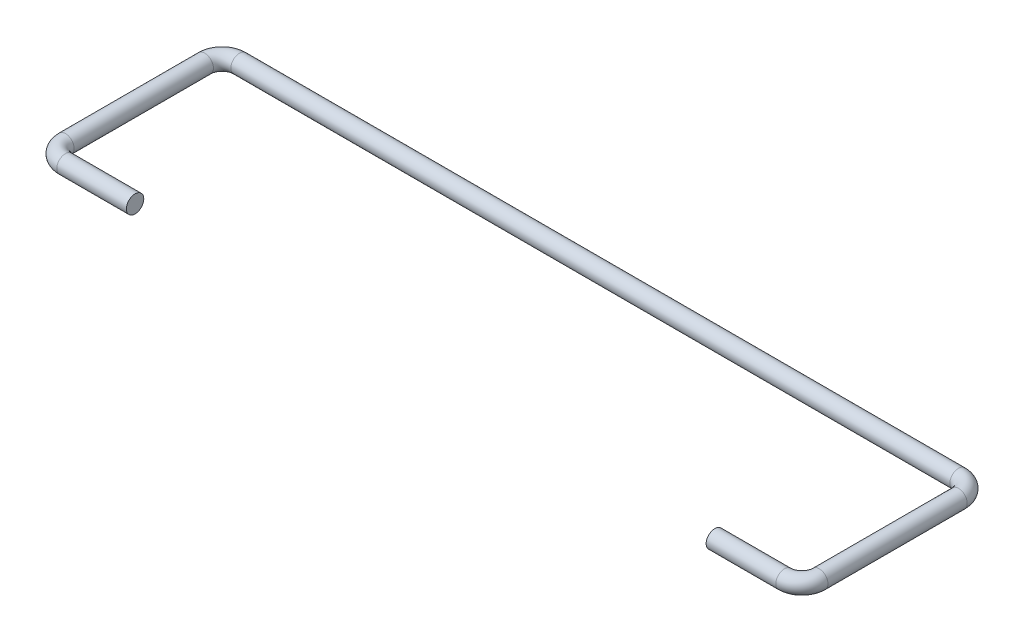
ISO-10303-21;
HEADER;
FILE_DESCRIPTION(('STEP AP214'),'2;1');
FILE_NAME('part.step','',(''),(''),'','','');
FILE_SCHEMA(('AUTOMOTIVE_DESIGN { 1 0 10303 214 1 1 1 1 }'));
ENDSEC;
DATA;
#1=APPLICATION_CONTEXT('core data for automotive mechanical design processes');
#2=APPLICATION_PROTOCOL_DEFINITION('international standard','automotive_design',2000,#1);
#3=PRODUCT_CONTEXT('',#1,'mechanical');
#4=PRODUCT('Part','Part','',(#3));
#5=PRODUCT_RELATED_PRODUCT_CATEGORY('part','',(#4));
#6=PRODUCT_DEFINITION_FORMATION('','',#4);
#7=PRODUCT_DEFINITION_CONTEXT('part definition',#1,'design');
#8=PRODUCT_DEFINITION('design','',#6,#7);
#9=PRODUCT_DEFINITION_SHAPE('','',#8);
#10=(LENGTH_UNIT() NAMED_UNIT(*) SI_UNIT(.MILLI.,.METRE.));
#11=(NAMED_UNIT(*) PLANE_ANGLE_UNIT() SI_UNIT($,.RADIAN.));
#12=(NAMED_UNIT(*) SI_UNIT($,.STERADIAN.) SOLID_ANGLE_UNIT());
#13=UNCERTAINTY_MEASURE_WITH_UNIT(LENGTH_MEASURE(1.E-05),#10,'distance_accuracy_value','');
#14=(GEOMETRIC_REPRESENTATION_CONTEXT(3) GLOBAL_UNCERTAINTY_ASSIGNED_CONTEXT((#13)) GLOBAL_UNIT_ASSIGNED_CONTEXT((#10,
#11,#12)) REPRESENTATION_CONTEXT('',''));
#15=CARTESIAN_POINT('',(0.,0.,0.));
#16=DIRECTION('',(0.,0.,1.));
#17=DIRECTION('',(1.,0.,0.));
#18=AXIS2_PLACEMENT_3D('',#15,#16,#17);
#19=CARTESIAN_POINT('',(-42.3,0.,0.));
#20=DIRECTION('',(1.,0.,0.));
#21=DIRECTION('',(0.,0.,-1.));
#22=AXIS2_PLACEMENT_3D('',#19,#20,#21);
#23=PLANE('',#22);
#24=CARTESIAN_POINT('',(-42.3,0.,0.));
#25=DIRECTION('',(1.,0.,0.));
#26=DIRECTION('',(0.,0.,-1.));
#27=AXIS2_PLACEMENT_3D('',#24,#25,#26);
#28=CIRCLE('',#27,1.27);
#29=CARTESIAN_POINT('',(-42.3,0.,-1.27));
#30=VERTEX_POINT('',#29);
#31=EDGE_CURVE('E80',#30,#30,#28,.T.);
#32=ORIENTED_EDGE('',*,*,#31,.T.);
#33=EDGE_LOOP('',(#32));
#34=FACE_BOUND('',#33,.T.);
#35=ADVANCED_FACE('F37',(#34),#23,.T.);
#36=CARTESIAN_POINT('',(42.3,0.,0.));
#37=DIRECTION('',(1.,0.,0.));
#38=DIRECTION('',(0.,0.,-1.));
#39=AXIS2_PLACEMENT_3D('',#36,#37,#38);
#40=PLANE('',#39);
#41=CARTESIAN_POINT('',(42.3,0.,0.));
#42=DIRECTION('',(1.,0.,0.));
#43=DIRECTION('',(0.,0.,-1.));
#44=AXIS2_PLACEMENT_3D('',#41,#42,#43);
#45=CIRCLE('',#44,1.27);
#46=CARTESIAN_POINT('',(42.3,0.,-1.27));
#47=VERTEX_POINT('',#46);
#48=EDGE_CURVE('E10',#47,#47,#45,.T.);
#49=ORIENTED_EDGE('',*,*,#48,.F.);
#50=EDGE_LOOP('',(#49));
#51=FACE_BOUND('',#50,.T.);
#52=ADVANCED_FACE('F89',(#51),#40,.F.);
#53=CARTESIAN_POINT('',(-42.3,0.,0.));
#54=DIRECTION('',(-1.,0.,0.));
#55=DIRECTION('',(0.,0.,1.));
#56=AXIS2_PLACEMENT_3D('',#53,#54,#55);
#57=CYLINDRICAL_SURFACE('',#56,1.27);
#58=CARTESIAN_POINT('',(-52.46,0.,0.));
#59=DIRECTION('',(1.,0.,0.));
#60=DIRECTION('',(0.,0.,-1.));
#61=AXIS2_PLACEMENT_3D('',#58,#59,#60);
#62=CIRCLE('',#61,1.27);
#63=CARTESIAN_POINT('',(-52.46,0.,1.27));
#64=VERTEX_POINT('',#63);
#65=EDGE_CURVE('E76',#64,#64,#62,.T.);
#66=ORIENTED_EDGE('',*,*,#65,.T.);
#67=EDGE_LOOP('',(#66));
#68=FACE_BOUND('',#67,.T.);
#69=ORIENTED_EDGE('',*,*,#31,.F.);
#70=EDGE_LOOP('',(#69));
#71=FACE_BOUND('',#70,.T.);
#72=ADVANCED_FACE('F86',(#68,#71),#57,.T.);
#73=CARTESIAN_POINT('',(-52.46,0.,-2.54));
#74=DIRECTION('',(0.,-1.,0.));
#75=DIRECTION('',(0.,0.,-1.));
#76=AXIS2_PLACEMENT_3D('',#73,#74,#75);
#77=TOROIDAL_SURFACE('',#76,2.54,1.27);
#78=CARTESIAN_POINT('',(-55.,0.,-2.54));
#79=DIRECTION('',(0.,0.,1.));
#80=DIRECTION('',(1.,0.,0.));
#81=AXIS2_PLACEMENT_3D('',#78,#79,#80);
#82=CIRCLE('',#81,1.27);
#83=CARTESIAN_POINT('',(-56.27,0.,-2.54));
#84=VERTEX_POINT('',#83);
#85=EDGE_CURVE('E72',#84,#84,#82,.T.);
#86=CARTESIAN_POINT('',(-52.46,0.,-2.54));
#87=DIRECTION('',(0.,-1.,0.));
#88=DIRECTION('',(0.,0.,-1.));
#89=AXIS2_PLACEMENT_3D('',#86,#87,#88);
#90=CIRCLE('',#89,3.81);
#91=EDGE_CURVE('',#64,#84,#90,.T.);
#92=ORIENTED_EDGE('',*,*,#65,.F.);
#93=ORIENTED_EDGE('',*,*,#85,.T.);
#94=ORIENTED_EDGE('',*,*,#91,.T.);
#95=ORIENTED_EDGE('',*,*,#91,.F.);
#96=EDGE_LOOP('',(#92,#94,#93,#95));
#97=FACE_BOUND('',#96,.T.);
#98=ADVANCED_FACE('F88',(#97),#77,.T.);
#99=CARTESIAN_POINT('',(-55.,0.,-2.54));
#100=DIRECTION('',(0.,0.,-1.));
#101=DIRECTION('',(-1.,0.,0.));
#102=AXIS2_PLACEMENT_3D('',#99,#100,#101);
#103=CYLINDRICAL_SURFACE('',#102,1.27);
#104=CARTESIAN_POINT('',(-55.,0.,-22.86));
#105=DIRECTION('',(0.,0.,1.));
#106=DIRECTION('',(1.,0.,0.));
#107=AXIS2_PLACEMENT_3D('',#104,#105,#106);
#108=CIRCLE('',#107,1.27);
#109=CARTESIAN_POINT('',(-56.27,0.,-22.86));
#110=VERTEX_POINT('',#109);
#111=EDGE_CURVE('E68',#110,#110,#108,.T.);
#112=ORIENTED_EDGE('',*,*,#111,.T.);
#113=EDGE_LOOP('',(#112));
#114=FACE_BOUND('',#113,.T.);
#115=ORIENTED_EDGE('',*,*,#85,.F.);
#116=EDGE_LOOP('',(#115));
#117=FACE_BOUND('',#116,.T.);
#118=ADVANCED_FACE('F96',(#114,#117),#103,.T.);
#119=CARTESIAN_POINT('',(-52.46,0.,-22.86));
#120=DIRECTION('',(0.,-1.,0.));
#121=DIRECTION('',(0.,0.,-1.));
#122=AXIS2_PLACEMENT_3D('',#119,#120,#121);
#123=TOROIDAL_SURFACE('',#122,2.53999999999999,1.27);
#124=CARTESIAN_POINT('',(-52.46,0.,-25.4));
#125=DIRECTION('',(-1.,0.,0.));
#126=DIRECTION('',(0.,0.,1.));
#127=AXIS2_PLACEMENT_3D('',#124,#125,#126);
#128=CIRCLE('',#127,1.27);
#129=CARTESIAN_POINT('',(-52.46,0.,-26.67));
#130=VERTEX_POINT('',#129);
#131=EDGE_CURVE('E64',#130,#130,#128,.T.);
#132=CARTESIAN_POINT('',(-52.46,0.,-22.86));
#133=DIRECTION('',(0.,-1.,0.));
#134=DIRECTION('',(0.,0.,-1.));
#135=AXIS2_PLACEMENT_3D('',#132,#133,#134);
#136=CIRCLE('',#135,3.80999999999999);
#137=EDGE_CURVE('',#110,#130,#136,.T.);
#138=ORIENTED_EDGE('',*,*,#111,.F.);
#139=ORIENTED_EDGE('',*,*,#131,.T.);
#140=ORIENTED_EDGE('',*,*,#137,.T.);
#141=ORIENTED_EDGE('',*,*,#137,.F.);
#142=EDGE_LOOP('',(#138,#140,#139,#141));
#143=FACE_BOUND('',#142,.T.);
#144=ADVANCED_FACE('F121',(#143),#123,.T.);
#145=CARTESIAN_POINT('',(-52.46,0.,-25.4));
#146=DIRECTION('',(1.,0.,0.));
#147=DIRECTION('',(0.,0.,-1.));
#148=AXIS2_PLACEMENT_3D('',#145,#146,#147);
#149=CYLINDRICAL_SURFACE('',#148,1.27);
#150=CARTESIAN_POINT('',(52.46,0.,-25.4));
#151=DIRECTION('',(-1.,0.,0.));
#152=DIRECTION('',(0.,0.,1.));
#153=AXIS2_PLACEMENT_3D('',#150,#151,#152);
#154=CIRCLE('',#153,1.27);
#155=CARTESIAN_POINT('',(52.46,0.,-26.67));
#156=VERTEX_POINT('',#155);
#157=EDGE_CURVE('E60',#156,#156,#154,.T.);
#158=ORIENTED_EDGE('',*,*,#157,.T.);
#159=EDGE_LOOP('',(#158));
#160=FACE_BOUND('',#159,.T.);
#161=ORIENTED_EDGE('',*,*,#131,.F.);
#162=EDGE_LOOP('',(#161));
#163=FACE_BOUND('',#162,.T.);
#164=ADVANCED_FACE('F117',(#160,#163),#149,.T.);
#165=CARTESIAN_POINT('',(52.46,0.,-22.86));
#166=DIRECTION('',(0.,-1.,0.));
#167=DIRECTION('',(0.,0.,-1.));
#168=AXIS2_PLACEMENT_3D('',#165,#166,#167);
#169=TOROIDAL_SURFACE('',#168,2.54,1.27);
#170=CARTESIAN_POINT('',(55.,0.,-22.86));
#171=DIRECTION('',(0.,0.,-1.));
#172=DIRECTION('',(-1.,0.,0.));
#173=AXIS2_PLACEMENT_3D('',#170,#171,#172);
#174=CIRCLE('',#173,1.27);
#175=CARTESIAN_POINT('',(56.27,0.,-22.86));
#176=VERTEX_POINT('',#175);
#177=EDGE_CURVE('E54',#176,#176,#174,.T.);
#178=CARTESIAN_POINT('',(52.46,0.,-22.86));
#179=DIRECTION('',(0.,-1.,0.));
#180=DIRECTION('',(0.,0.,-1.));
#181=AXIS2_PLACEMENT_3D('',#178,#179,#180);
#182=CIRCLE('',#181,3.81);
#183=EDGE_CURVE('',#156,#176,#182,.T.);
#184=ORIENTED_EDGE('',*,*,#157,.F.);
#185=ORIENTED_EDGE('',*,*,#177,.T.);
#186=ORIENTED_EDGE('',*,*,#183,.T.);
#187=ORIENTED_EDGE('',*,*,#183,.F.);
#188=EDGE_LOOP('',(#184,#186,#185,#187));
#189=FACE_BOUND('',#188,.T.);
#190=ADVANCED_FACE('F113',(#189),#169,.T.);
#191=CARTESIAN_POINT('',(55.,0.,-22.86));
#192=DIRECTION('',(0.,0.,1.));
#193=DIRECTION('',(1.,0.,0.));
#194=AXIS2_PLACEMENT_3D('',#191,#192,#193);
#195=CYLINDRICAL_SURFACE('',#194,1.27);
#196=CARTESIAN_POINT('',(55.,0.,-2.54));
#197=DIRECTION('',(0.,0.,-1.));
#198=DIRECTION('',(-1.,0.,0.));
#199=AXIS2_PLACEMENT_3D('',#196,#197,#198);
#200=CIRCLE('',#199,1.27);
#201=CARTESIAN_POINT('',(56.27,0.,-2.54));
#202=VERTEX_POINT('',#201);
#203=EDGE_CURVE('E49',#202,#202,#200,.T.);
#204=ORIENTED_EDGE('',*,*,#203,.T.);
#205=EDGE_LOOP('',(#204));
#206=FACE_BOUND('',#205,.T.);
#207=ORIENTED_EDGE('',*,*,#177,.F.);
#208=EDGE_LOOP('',(#207));
#209=FACE_BOUND('',#208,.T.);
#210=ADVANCED_FACE('F107',(#206,#209),#195,.T.);
#211=CARTESIAN_POINT('',(52.46,0.,-2.54));
#212=DIRECTION('',(0.,-1.,0.));
#213=DIRECTION('',(0.,0.,-1.));
#214=AXIS2_PLACEMENT_3D('',#211,#212,#213);
#215=TOROIDAL_SURFACE('',#214,2.53999999999999,1.27);
#216=CARTESIAN_POINT('',(52.46,0.,0.));
#217=DIRECTION('',(1.,0.,0.));
#218=DIRECTION('',(0.,0.,-1.));
#219=AXIS2_PLACEMENT_3D('',#216,#217,#218);
#220=CIRCLE('',#219,1.27);
#221=CARTESIAN_POINT('',(52.46,0.,1.26999999999999));
#222=VERTEX_POINT('',#221);
#223=EDGE_CURVE('E44',#222,#222,#220,.T.);
#224=CARTESIAN_POINT('',(52.46,0.,-2.54));
#225=DIRECTION('',(0.,-1.,0.));
#226=DIRECTION('',(0.,0.,-1.));
#227=AXIS2_PLACEMENT_3D('',#224,#225,#226);
#228=CIRCLE('',#227,3.80999999999999);
#229=EDGE_CURVE('',#202,#222,#228,.T.);
#230=ORIENTED_EDGE('',*,*,#203,.F.);
#231=ORIENTED_EDGE('',*,*,#223,.T.);
#232=ORIENTED_EDGE('',*,*,#229,.T.);
#233=ORIENTED_EDGE('',*,*,#229,.F.);
#234=EDGE_LOOP('',(#230,#232,#231,#233));
#235=FACE_BOUND('',#234,.T.);
#236=ADVANCED_FACE('F102',(#235),#215,.T.);
#237=CARTESIAN_POINT('',(52.46,0.,0.));
#238=DIRECTION('',(-1.,0.,0.));
#239=DIRECTION('',(0.,0.,1.));
#240=AXIS2_PLACEMENT_3D('',#237,#238,#239);
#241=CYLINDRICAL_SURFACE('',#240,1.27);
#242=ORIENTED_EDGE('',*,*,#48,.T.);
#243=EDGE_LOOP('',(#242));
#244=FACE_BOUND('',#243,.T.);
#245=ORIENTED_EDGE('',*,*,#223,.F.);
#246=EDGE_LOOP('',(#245));
#247=FACE_BOUND('',#246,.T.);
#248=ADVANCED_FACE('F100',(#244,#247),#241,.T.);
#249=CLOSED_SHELL('',(#35,#52,#72,#98,#118,#144,#164,#190,#210,#236,#248));
#250=MANIFOLD_SOLID_BREP('B2',#249);
#251=ADVANCED_BREP_SHAPE_REPRESENTATION('',(#18,#250),#14);
#252=SHAPE_DEFINITION_REPRESENTATION(#9,#251);
ENDSEC;
END-ISO-10303-21;
